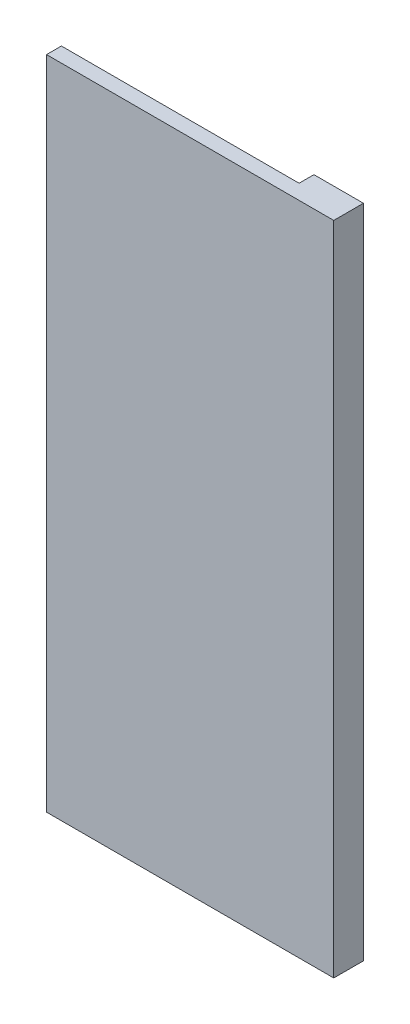
ISO-10303-21;
HEADER;
FILE_DESCRIPTION(('STEP AP214'),'2;1');
FILE_NAME('part.step','',(''),(''),'','','');
FILE_SCHEMA(('AUTOMOTIVE_DESIGN { 1 0 10303 214 1 1 1 1 }'));
ENDSEC;
DATA;
#1=APPLICATION_CONTEXT('core data for automotive mechanical design processes');
#2=APPLICATION_PROTOCOL_DEFINITION('international standard','automotive_design',2000,#1);
#3=PRODUCT_CONTEXT('',#1,'mechanical');
#4=PRODUCT('Part','Part','',(#3));
#5=PRODUCT_RELATED_PRODUCT_CATEGORY('part','',(#4));
#6=PRODUCT_DEFINITION_FORMATION('','',#4);
#7=PRODUCT_DEFINITION_CONTEXT('part definition',#1,'design');
#8=PRODUCT_DEFINITION('design','',#6,#7);
#9=PRODUCT_DEFINITION_SHAPE('','',#8);
#10=(LENGTH_UNIT() NAMED_UNIT(*) SI_UNIT(.MILLI.,.METRE.));
#11=(NAMED_UNIT(*) PLANE_ANGLE_UNIT() SI_UNIT($,.RADIAN.));
#12=(NAMED_UNIT(*) SI_UNIT($,.STERADIAN.) SOLID_ANGLE_UNIT());
#13=UNCERTAINTY_MEASURE_WITH_UNIT(LENGTH_MEASURE(1.E-05),#10,'distance_accuracy_value','');
#14=(GEOMETRIC_REPRESENTATION_CONTEXT(3) GLOBAL_UNCERTAINTY_ASSIGNED_CONTEXT((#13)) GLOBAL_UNIT_ASSIGNED_CONTEXT((#10,
#11,#12)) REPRESENTATION_CONTEXT('',''));
#15=CARTESIAN_POINT('',(0.,0.,0.));
#16=DIRECTION('',(0.,0.,1.));
#17=DIRECTION('',(1.,0.,0.));
#18=AXIS2_PLACEMENT_3D('',#15,#16,#17);
#19=CARTESIAN_POINT('',(0.,245.,-6.));
#20=DIRECTION('',(0.,-1.,0.));
#21=DIRECTION('',(0.,0.,-1.));
#22=AXIS2_PLACEMENT_3D('',#19,#20,#21);
#23=PLANE('',#22);
#24=DIRECTION('',(0.,0.,1.));
#25=VECTOR('',#24,1.);
#26=CARTESIAN_POINT('',(48.,245.,-6.));
#27=LINE('',#26,#25);
#28=CARTESIAN_POINT('',(48.,245.,-6.));
#29=VERTEX_POINT('',#28);
#30=CARTESIAN_POINT('',(48.,245.,0.));
#31=VERTEX_POINT('',#30);
#32=EDGE_CURVE('E36',#29,#31,#27,.T.);
#33=ORIENTED_EDGE('',*,*,#32,.T.);
#34=DIRECTION('',(-1.,0.,0.));
#35=VECTOR('',#34,1.);
#36=CARTESIAN_POINT('',(68.0000000000001,245.,0.));
#37=LINE('',#36,#35);
#38=CARTESIAN_POINT('',(-48.,245.,0.));
#39=VERTEX_POINT('',#38);
#40=EDGE_CURVE('E114',#31,#39,#37,.T.);
#41=ORIENTED_EDGE('',*,*,#40,.T.);
#42=DIRECTION('',(0.,0.,-1.));
#43=VECTOR('',#42,1.);
#44=CARTESIAN_POINT('',(-48.,245.,6.));
#45=LINE('',#44,#43);
#46=CARTESIAN_POINT('',(-48.,245.,6.));
#47=VERTEX_POINT('',#46);
#48=EDGE_CURVE('E134',#47,#39,#45,.T.);
#49=ORIENTED_EDGE('',*,*,#48,.F.);
#50=DIRECTION('',(-1.,0.,0.));
#51=VECTOR('',#50,1.);
#52=CARTESIAN_POINT('',(68.0000000000001,245.,6.));
#53=LINE('',#52,#51);
#54=CARTESIAN_POINT('',(68.0000000000001,245.,6.));
#55=VERTEX_POINT('',#54);
#56=EDGE_CURVE('E161',#55,#47,#53,.T.);
#57=ORIENTED_EDGE('',*,*,#56,.F.);
#58=DIRECTION('',(0.,0.,1.));
#59=VECTOR('',#58,1.);
#60=CARTESIAN_POINT('',(67.9999999999999,245.,-6.));
#61=LINE('',#60,#59);
#62=CARTESIAN_POINT('',(67.9999999999999,245.,-6.));
#63=VERTEX_POINT('',#62);
#64=EDGE_CURVE('E11',#63,#55,#61,.T.);
#65=ORIENTED_EDGE('',*,*,#64,.F.);
#66=DIRECTION('',(1.,0.,0.));
#67=VECTOR('',#66,1.);
#68=CARTESIAN_POINT('',(0.,245.,-6.));
#69=LINE('',#68,#67);
#70=EDGE_CURVE('E124',#29,#63,#69,.T.);
#71=ORIENTED_EDGE('',*,*,#70,.F.);
#72=EDGE_LOOP('',(#33,#41,#49,#57,#65,#71));
#73=FACE_BOUND('',#72,.T.);
#74=ADVANCED_FACE('F33',(#73),#23,.F.);
#75=CARTESIAN_POINT('',(68.0000000000001,0.,-6.));
#76=DIRECTION('',(-1.,0.,0.));
#77=DIRECTION('',(0.,-1.,0.));
#78=AXIS2_PLACEMENT_3D('',#75,#76,#77);
#79=PLANE('',#78);
#80=ORIENTED_EDGE('',*,*,#64,.T.);
#81=DIRECTION('',(0.,1.,0.));
#82=VECTOR('',#81,1.);
#83=CARTESIAN_POINT('',(68.0000000000001,-20.,6.));
#84=LINE('',#83,#82);
#85=CARTESIAN_POINT('',(68.0000000000001,-20.,6.));
#86=VERTEX_POINT('',#85);
#87=EDGE_CURVE('E154',#86,#55,#84,.T.);
#88=ORIENTED_EDGE('',*,*,#87,.F.);
#89=DIRECTION('',(0.,0.,1.));
#90=VECTOR('',#89,1.);
#91=CARTESIAN_POINT('',(68.0000000000001,-20.,-6.));
#92=LINE('',#91,#90);
#93=CARTESIAN_POINT('',(68.0000000000001,-20.,-6.));
#94=VERTEX_POINT('',#93);
#95=EDGE_CURVE('E41',#94,#86,#92,.T.);
#96=ORIENTED_EDGE('',*,*,#95,.F.);
#97=DIRECTION('',(0.,-1.,0.));
#98=VECTOR('',#97,1.);
#99=CARTESIAN_POINT('',(68.0000000000001,0.,-6.));
#100=LINE('',#99,#98);
#101=EDGE_CURVE('E56',#63,#94,#100,.T.);
#102=ORIENTED_EDGE('',*,*,#101,.F.);
#103=EDGE_LOOP('',(#80,#88,#96,#102));
#104=FACE_BOUND('',#103,.T.);
#105=ADVANCED_FACE('F164',(#104),#79,.F.);
#106=CARTESIAN_POINT('',(0.,-20.,-6.));
#107=DIRECTION('',(0.,-1.,0.));
#108=DIRECTION('',(1.,0.,0.));
#109=AXIS2_PLACEMENT_3D('',#106,#107,#108);
#110=PLANE('',#109);
#111=ORIENTED_EDGE('',*,*,#95,.T.);
#112=DIRECTION('',(1.,0.,0.));
#113=VECTOR('',#112,1.);
#114=CARTESIAN_POINT('',(68.0000000000001,-20.,6.));
#115=LINE('',#114,#113);
#116=CARTESIAN_POINT('',(-48.,-20.,6.));
#117=VERTEX_POINT('',#116);
#118=EDGE_CURVE('E157',#117,#86,#115,.T.);
#119=ORIENTED_EDGE('',*,*,#118,.F.);
#120=DIRECTION('',(0.,0.,1.));
#121=VECTOR('',#120,1.);
#122=CARTESIAN_POINT('',(-48.,-20.,-6.));
#123=LINE('',#122,#121);
#124=CARTESIAN_POINT('',(-48.,-20.,-6.));
#125=VERTEX_POINT('',#124);
#126=EDGE_CURVE('E137',#125,#117,#123,.T.);
#127=ORIENTED_EDGE('',*,*,#126,.F.);
#128=DIRECTION('',(1.,0.,0.));
#129=VECTOR('',#128,1.);
#130=CARTESIAN_POINT('',(0.,-20.,-6.));
#131=LINE('',#130,#129);
#132=EDGE_CURVE('E122',#125,#94,#131,.T.);
#133=ORIENTED_EDGE('',*,*,#132,.T.);
#134=EDGE_LOOP('',(#111,#119,#127,#133));
#135=FACE_BOUND('',#134,.T.);
#136=ADVANCED_FACE('F176',(#135),#110,.T.);
#137=CARTESIAN_POINT('',(-48.,0.,-6.));
#138=DIRECTION('',(-1.,0.,0.));
#139=DIRECTION('',(0.,-1.,0.));
#140=AXIS2_PLACEMENT_3D('',#137,#138,#139);
#141=PLANE('',#140);
#142=ORIENTED_EDGE('',*,*,#126,.T.);
#143=DIRECTION('',(0.,-1.,0.));
#144=VECTOR('',#143,1.);
#145=CARTESIAN_POINT('',(-48.,-20.,6.));
#146=LINE('',#145,#144);
#147=EDGE_CURVE('E168',#47,#117,#146,.T.);
#148=ORIENTED_EDGE('',*,*,#147,.F.);
#149=ORIENTED_EDGE('',*,*,#48,.T.);
#150=DIRECTION('',(0.,-1.,0.));
#151=VECTOR('',#150,1.);
#152=CARTESIAN_POINT('',(-48.,-20.,0.));
#153=LINE('',#152,#151);
#154=CARTESIAN_POINT('',(-48.,0.,0.));
#155=VERTEX_POINT('',#154);
#156=EDGE_CURVE('E152',#39,#155,#153,.T.);
#157=ORIENTED_EDGE('',*,*,#156,.T.);
#158=DIRECTION('',(0.,0.,1.));
#159=VECTOR('',#158,1.);
#160=CARTESIAN_POINT('',(-48.,0.,-6.));
#161=LINE('',#160,#159);
#162=CARTESIAN_POINT('',(-48.,0.,-6.));
#163=VERTEX_POINT('',#162);
#164=EDGE_CURVE('E138',#163,#155,#161,.T.);
#165=ORIENTED_EDGE('',*,*,#164,.F.);
#166=DIRECTION('',(0.,-1.,0.));
#167=VECTOR('',#166,1.);
#168=CARTESIAN_POINT('',(-48.,0.,-6.));
#169=LINE('',#168,#167);
#170=EDGE_CURVE('E119',#163,#125,#169,.T.);
#171=ORIENTED_EDGE('',*,*,#170,.T.);
#172=EDGE_LOOP('',(#142,#148,#149,#157,#165,#171));
#173=FACE_BOUND('',#172,.T.);
#174=ADVANCED_FACE('F178',(#173),#141,.T.);
#175=CARTESIAN_POINT('',(0.,0.,-6.));
#176=DIRECTION('',(0.,-1.,0.));
#177=DIRECTION('',(0.,0.,-1.));
#178=AXIS2_PLACEMENT_3D('',#175,#176,#177);
#179=PLANE('',#178);
#180=DIRECTION('',(1.,0.,0.));
#181=VECTOR('',#180,1.);
#182=CARTESIAN_POINT('',(0.,0.,0.));
#183=LINE('',#182,#181);
#184=CARTESIAN_POINT('',(38.,0.,0.));
#185=VERTEX_POINT('',#184);
#186=EDGE_CURVE('E113',#155,#185,#183,.T.);
#187=ORIENTED_EDGE('',*,*,#186,.T.);
#188=DIRECTION('',(0.,0.,-1.));
#189=VECTOR('',#188,1.);
#190=CARTESIAN_POINT('',(38.,0.,28.2842712474619));
#191=LINE('',#190,#189);
#192=CARTESIAN_POINT('',(38.,0.,-6.));
#193=VERTEX_POINT('',#192);
#194=EDGE_CURVE('E98',#185,#193,#191,.T.);
#195=ORIENTED_EDGE('',*,*,#194,.T.);
#196=DIRECTION('',(1.,0.,0.));
#197=VECTOR('',#196,1.);
#198=CARTESIAN_POINT('',(0.,0.,-6.));
#199=LINE('',#198,#197);
#200=EDGE_CURVE('E111',#163,#193,#199,.T.);
#201=ORIENTED_EDGE('',*,*,#200,.F.);
#202=ORIENTED_EDGE('',*,*,#164,.T.);
#203=EDGE_LOOP('',(#187,#195,#201,#202));
#204=FACE_BOUND('',#203,.T.);
#205=ADVANCED_FACE('F109',(#204),#179,.F.);
#206=CARTESIAN_POINT('',(48.,0.,-6.));
#207=DIRECTION('',(-1.,0.,0.));
#208=DIRECTION('',(0.,0.,1.));
#209=AXIS2_PLACEMENT_3D('',#206,#207,#208);
#210=PLANE('',#209);
#211=DIRECTION('',(0.,0.,-1.));
#212=VECTOR('',#211,1.);
#213=CARTESIAN_POINT('',(48.,10.0000000000001,28.2842712474619));
#214=LINE('',#213,#212);
#215=CARTESIAN_POINT('',(48.,10.0000000000001,0.));
#216=VERTEX_POINT('',#215);
#217=CARTESIAN_POINT('',(48.,10.0000000000001,-6.));
#218=VERTEX_POINT('',#217);
#219=EDGE_CURVE('E49',#216,#218,#214,.T.);
#220=ORIENTED_EDGE('',*,*,#219,.F.);
#221=DIRECTION('',(0.,-1.,0.));
#222=VECTOR('',#221,1.);
#223=CARTESIAN_POINT('',(48.,0.,0.));
#224=LINE('',#223,#222);
#225=EDGE_CURVE('E131',#31,#216,#224,.T.);
#226=ORIENTED_EDGE('',*,*,#225,.F.);
#227=ORIENTED_EDGE('',*,*,#32,.F.);
#228=DIRECTION('',(0.,-1.,0.));
#229=VECTOR('',#228,1.);
#230=CARTESIAN_POINT('',(48.,0.,-6.));
#231=LINE('',#230,#229);
#232=EDGE_CURVE('E120',#29,#218,#231,.T.);
#233=ORIENTED_EDGE('',*,*,#232,.T.);
#234=EDGE_LOOP('',(#220,#226,#227,#233));
#235=FACE_BOUND('',#234,.T.);
#236=ADVANCED_FACE('F147',(#235),#210,.T.);
#237=CARTESIAN_POINT('',(0.,0.,-6.));
#238=DIRECTION('',(0.,0.,1.));
#239=DIRECTION('',(1.,0.,0.));
#240=AXIS2_PLACEMENT_3D('',#237,#238,#239);
#241=PLANE('',#240);
#242=ORIENTED_EDGE('',*,*,#200,.T.);
#243=CARTESIAN_POINT('',(48.,0.,-6.));
#244=DIRECTION('',(0.,0.,-1.));
#245=DIRECTION('',(0.,1.,0.));
#246=AXIS2_PLACEMENT_3D('',#243,#244,#245);
#247=CIRCLE('',#246,10.);
#248=EDGE_CURVE('E95',#218,#193,#247,.T.);
#249=ORIENTED_EDGE('',*,*,#248,.F.);
#250=ORIENTED_EDGE('',*,*,#232,.F.);
#251=ORIENTED_EDGE('',*,*,#70,.T.);
#252=ORIENTED_EDGE('',*,*,#101,.T.);
#253=ORIENTED_EDGE('',*,*,#132,.F.);
#254=ORIENTED_EDGE('',*,*,#170,.F.);
#255=EDGE_LOOP('',(#242,#249,#250,#251,#252,#253,#254));
#256=FACE_BOUND('',#255,.T.);
#257=ADVANCED_FACE('F116',(#256),#241,.F.);
#258=CARTESIAN_POINT('',(0.,0.,0.));
#259=DIRECTION('',(0.,0.,1.));
#260=DIRECTION('',(1.,0.,0.));
#261=AXIS2_PLACEMENT_3D('',#258,#259,#260);
#262=PLANE('',#261);
#263=ORIENTED_EDGE('',*,*,#225,.T.);
#264=CARTESIAN_POINT('',(48.,0.,0.));
#265=DIRECTION('',(0.,0.,1.));
#266=DIRECTION('',(1.,0.,0.));
#267=AXIS2_PLACEMENT_3D('',#264,#265,#266);
#268=CIRCLE('',#267,10.);
#269=EDGE_CURVE('E104',#216,#185,#268,.F.);
#270=ORIENTED_EDGE('',*,*,#269,.T.);
#271=ORIENTED_EDGE('',*,*,#186,.F.);
#272=ORIENTED_EDGE('',*,*,#156,.F.);
#273=ORIENTED_EDGE('',*,*,#40,.F.);
#274=EDGE_LOOP('',(#263,#270,#271,#272,#273));
#275=FACE_BOUND('',#274,.T.);
#276=ADVANCED_FACE('F149',(#275),#262,.F.);
#277=CARTESIAN_POINT('',(0.,0.,6.));
#278=DIRECTION('',(0.,0.,1.));
#279=DIRECTION('',(1.,0.,0.));
#280=AXIS2_PLACEMENT_3D('',#277,#278,#279);
#281=PLANE('',#280);
#282=ORIENTED_EDGE('',*,*,#87,.T.);
#283=ORIENTED_EDGE('',*,*,#56,.T.);
#284=ORIENTED_EDGE('',*,*,#147,.T.);
#285=ORIENTED_EDGE('',*,*,#118,.T.);
#286=EDGE_LOOP('',(#282,#283,#284,#285));
#287=FACE_BOUND('',#286,.T.);
#288=ADVANCED_FACE('F174',(#287),#281,.T.);
#289=CARTESIAN_POINT('',(48.,0.,28.2842712474619));
#290=DIRECTION('',(0.,0.,-1.));
#291=DIRECTION('',(0.,1.,0.));
#292=AXIS2_PLACEMENT_3D('',#289,#290,#291);
#293=CYLINDRICAL_SURFACE('',#292,10.);
#294=ORIENTED_EDGE('',*,*,#269,.F.);
#295=ORIENTED_EDGE('',*,*,#219,.T.);
#296=ORIENTED_EDGE('',*,*,#248,.T.);
#297=ORIENTED_EDGE('',*,*,#194,.F.);
#298=EDGE_LOOP('',(#294,#295,#296,#297));
#299=FACE_BOUND('',#298,.T.);
#300=ADVANCED_FACE('F97',(#299),#293,.F.);
#301=CLOSED_SHELL('',(#74,#105,#136,#174,#205,#236,#257,#276,#288,#300));
#302=MANIFOLD_SOLID_BREP('B2',#301);
#303=ADVANCED_BREP_SHAPE_REPRESENTATION('',(#18,#302),#14);
#304=SHAPE_DEFINITION_REPRESENTATION(#9,#303);
ENDSEC;
END-ISO-10303-21;
